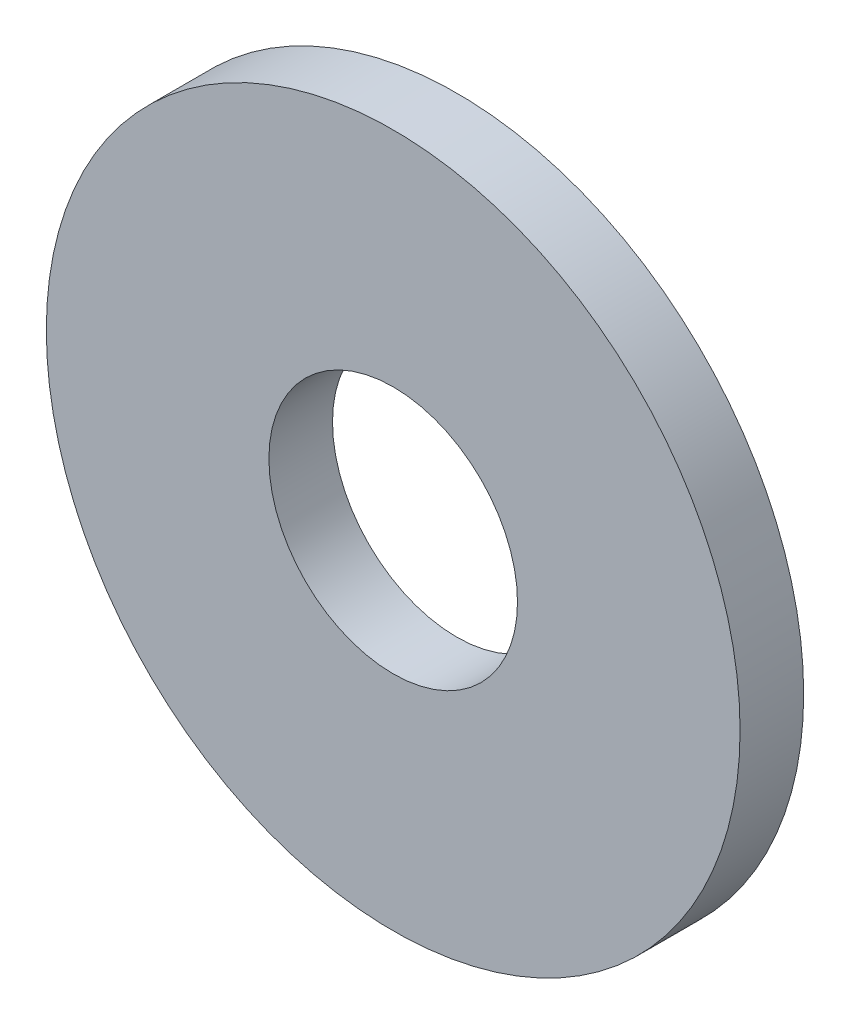
ISO-10303-21;
HEADER;
FILE_DESCRIPTION(('STEP AP214'),'2;1');
FILE_NAME('part.step','',(''),(''),'','','');
FILE_SCHEMA(('AUTOMOTIVE_DESIGN { 1 0 10303 214 1 1 1 1 }'));
ENDSEC;
DATA;
#1=APPLICATION_CONTEXT('core data for automotive mechanical design processes');
#2=APPLICATION_PROTOCOL_DEFINITION('international standard','automotive_design',2000,#1);
#3=PRODUCT_CONTEXT('',#1,'mechanical');
#4=PRODUCT('Part','Part','',(#3));
#5=PRODUCT_RELATED_PRODUCT_CATEGORY('part','',(#4));
#6=PRODUCT_DEFINITION_FORMATION('','',#4);
#7=PRODUCT_DEFINITION_CONTEXT('part definition',#1,'design');
#8=PRODUCT_DEFINITION('design','',#6,#7);
#9=PRODUCT_DEFINITION_SHAPE('','',#8);
#10=(LENGTH_UNIT() NAMED_UNIT(*) SI_UNIT(.MILLI.,.METRE.));
#11=(NAMED_UNIT(*) PLANE_ANGLE_UNIT() SI_UNIT($,.RADIAN.));
#12=(NAMED_UNIT(*) SI_UNIT($,.STERADIAN.) SOLID_ANGLE_UNIT());
#13=UNCERTAINTY_MEASURE_WITH_UNIT(LENGTH_MEASURE(1.E-05),#10,'distance_accuracy_value','');
#14=(GEOMETRIC_REPRESENTATION_CONTEXT(3) GLOBAL_UNCERTAINTY_ASSIGNED_CONTEXT((#13)) GLOBAL_UNIT_ASSIGNED_CONTEXT((#10,
#11,#12)) REPRESENTATION_CONTEXT('',''));
#15=CARTESIAN_POINT('',(0.,0.,0.));
#16=DIRECTION('',(0.,0.,1.));
#17=DIRECTION('',(1.,0.,0.));
#18=AXIS2_PLACEMENT_3D('',#15,#16,#17);
#19=CARTESIAN_POINT('',(0.,0.,1.1));
#20=DIRECTION('',(0.,0.,1.));
#21=DIRECTION('',(1.,0.,0.));
#22=AXIS2_PLACEMENT_3D('',#19,#20,#21);
#23=PLANE('',#22);
#24=CARTESIAN_POINT('',(0.,0.,1.1));
#25=DIRECTION('',(0.,0.,1.));
#26=DIRECTION('',(1.,0.,0.));
#27=AXIS2_PLACEMENT_3D('',#24,#25,#26);
#28=CIRCLE('',#27,6.);
#29=CARTESIAN_POINT('',(6.,0.,1.1));
#30=VERTEX_POINT('',#29);
#31=EDGE_CURVE('E10',#30,#30,#28,.T.);
#32=ORIENTED_EDGE('',*,*,#31,.T.);
#33=EDGE_LOOP('',(#32));
#34=FACE_BOUND('',#33,.T.);
#35=CARTESIAN_POINT('',(0.,0.,1.1));
#36=DIRECTION('',(0.,0.,1.));
#37=DIRECTION('',(1.,0.,0.));
#38=AXIS2_PLACEMENT_3D('',#35,#36,#37);
#39=CIRCLE('',#38,2.15);
#40=CARTESIAN_POINT('',(2.15,0.,1.1));
#41=VERTEX_POINT('',#40);
#42=EDGE_CURVE('E44',#41,#41,#39,.T.);
#43=ORIENTED_EDGE('',*,*,#42,.F.);
#44=EDGE_LOOP('',(#43));
#45=FACE_BOUND('',#44,.T.);
#46=ADVANCED_FACE('F33',(#34,#45),#23,.T.);
#47=CARTESIAN_POINT('',(0.,0.,0.));
#48=DIRECTION('',(0.,0.,1.));
#49=DIRECTION('',(1.,0.,0.));
#50=AXIS2_PLACEMENT_3D('',#47,#48,#49);
#51=PLANE('',#50);
#52=CARTESIAN_POINT('',(0.,0.,0.));
#53=DIRECTION('',(0.,0.,1.));
#54=DIRECTION('',(1.,0.,0.));
#55=AXIS2_PLACEMENT_3D('',#52,#53,#54);
#56=CIRCLE('',#55,6.);
#57=CARTESIAN_POINT('',(6.,0.,0.));
#58=VERTEX_POINT('',#57);
#59=EDGE_CURVE('E37',#58,#58,#56,.T.);
#60=ORIENTED_EDGE('',*,*,#59,.F.);
#61=EDGE_LOOP('',(#60));
#62=FACE_BOUND('',#61,.T.);
#63=CARTESIAN_POINT('',(0.,0.,0.));
#64=DIRECTION('',(0.,0.,1.));
#65=DIRECTION('',(1.,0.,0.));
#66=AXIS2_PLACEMENT_3D('',#63,#64,#65);
#67=CIRCLE('',#66,2.15);
#68=CARTESIAN_POINT('',(2.15,0.,0.));
#69=VERTEX_POINT('',#68);
#70=EDGE_CURVE('E46',#69,#69,#67,.T.);
#71=ORIENTED_EDGE('',*,*,#70,.T.);
#72=EDGE_LOOP('',(#71));
#73=FACE_BOUND('',#72,.T.);
#74=ADVANCED_FACE('F56',(#62,#73),#51,.F.);
#75=CARTESIAN_POINT('',(0.,0.,1.1));
#76=DIRECTION('',(0.,0.,-1.));
#77=DIRECTION('',(-1.,0.,0.));
#78=AXIS2_PLACEMENT_3D('',#75,#76,#77);
#79=CYLINDRICAL_SURFACE('',#78,6.);
#80=ORIENTED_EDGE('',*,*,#31,.F.);
#81=EDGE_LOOP('',(#80));
#82=FACE_BOUND('',#81,.T.);
#83=ORIENTED_EDGE('',*,*,#59,.T.);
#84=EDGE_LOOP('',(#83));
#85=FACE_BOUND('',#84,.T.);
#86=ADVANCED_FACE('F35',(#82,#85),#79,.T.);
#87=CARTESIAN_POINT('',(0.,0.,1.1));
#88=DIRECTION('',(0.,0.,-1.));
#89=DIRECTION('',(-1.,0.,0.));
#90=AXIS2_PLACEMENT_3D('',#87,#88,#89);
#91=CYLINDRICAL_SURFACE('',#90,2.15);
#92=ORIENTED_EDGE('',*,*,#42,.T.);
#93=EDGE_LOOP('',(#92));
#94=FACE_BOUND('',#93,.T.);
#95=ORIENTED_EDGE('',*,*,#70,.F.);
#96=EDGE_LOOP('',(#95));
#97=FACE_BOUND('',#96,.T.);
#98=ADVANCED_FACE('F52',(#94,#97),#91,.F.);
#99=CLOSED_SHELL('',(#46,#74,#86,#98));
#100=MANIFOLD_SOLID_BREP('B2',#99);
#101=ADVANCED_BREP_SHAPE_REPRESENTATION('',(#18,#100),#14);
#102=SHAPE_DEFINITION_REPRESENTATION(#9,#101);
ENDSEC;
END-ISO-10303-21;
